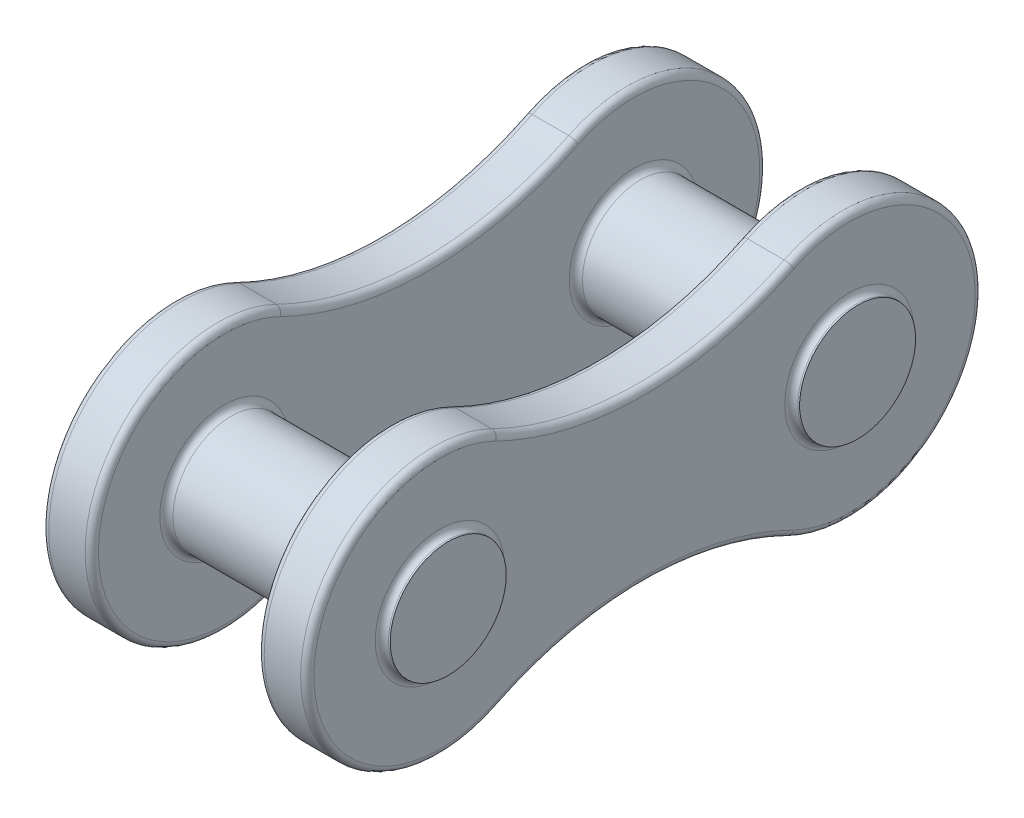
ISO-10303-21;
HEADER;
FILE_DESCRIPTION(('STEP AP214'),'2;1');
FILE_NAME('part.step','',(''),(''),'','','');
FILE_SCHEMA(('AUTOMOTIVE_DESIGN { 1 0 10303 214 1 1 1 1 }'));
ENDSEC;
DATA;
#1=APPLICATION_CONTEXT('core data for automotive mechanical design processes');
#2=APPLICATION_PROTOCOL_DEFINITION('international standard','automotive_design',2000,#1);
#3=PRODUCT_CONTEXT('',#1,'mechanical');
#4=PRODUCT('Part','Part','',(#3));
#5=PRODUCT_RELATED_PRODUCT_CATEGORY('part','',(#4));
#6=PRODUCT_DEFINITION_FORMATION('','',#4);
#7=PRODUCT_DEFINITION_CONTEXT('part definition',#1,'design');
#8=PRODUCT_DEFINITION('design','',#6,#7);
#9=PRODUCT_DEFINITION_SHAPE('','',#8);
#10=(LENGTH_UNIT() NAMED_UNIT(*) SI_UNIT(.MILLI.,.METRE.));
#11=(NAMED_UNIT(*) PLANE_ANGLE_UNIT() SI_UNIT($,.RADIAN.));
#12=(NAMED_UNIT(*) SI_UNIT($,.STERADIAN.) SOLID_ANGLE_UNIT());
#13=UNCERTAINTY_MEASURE_WITH_UNIT(LENGTH_MEASURE(1.E-05),#10,'distance_accuracy_value','');
#14=(GEOMETRIC_REPRESENTATION_CONTEXT(3) GLOBAL_UNCERTAINTY_ASSIGNED_CONTEXT((#13)) GLOBAL_UNIT_ASSIGNED_CONTEXT((#10,
#11,#12)) REPRESENTATION_CONTEXT('',''));
#15=CARTESIAN_POINT('',(0.,0.,0.));
#16=DIRECTION('',(0.,0.,1.));
#17=DIRECTION('',(1.,0.,0.));
#18=AXIS2_PLACEMENT_3D('',#15,#16,#17);
#19=CARTESIAN_POINT('',(4.,6.28230401604379,-3.0875));
#20=DIRECTION('',(1.,0.,0.));
#21=DIRECTION('',(0.,0.,-1.));
#22=AXIS2_PLACEMENT_3D('',#19,#20,#21);
#23=PLANE('',#22);
#24=CARTESIAN_POINT('',(4.,0.,-6.175));
#25=DIRECTION('',(1.,0.,0.));
#26=DIRECTION('',(0.,0.,-1.));
#27=AXIS2_PLACEMENT_3D('',#24,#25,#26);
#28=CIRCLE('',#27,1.95);
#29=CARTESIAN_POINT('',(4.,0.,-8.125));
#30=VERTEX_POINT('',#29);
#31=EDGE_CURVE('E45',#30,#30,#28,.F.);
#32=ORIENTED_EDGE('',*,*,#31,.T.);
#33=EDGE_LOOP('',(#32));
#34=FACE_BOUND('',#33,.T.);
#35=CARTESIAN_POINT('',(4.,-12.5646080320876,0.));
#36=DIRECTION('',(1.,0.,0.));
#37=DIRECTION('',(0.,0.,-1.));
#38=AXIS2_PLACEMENT_3D('',#35,#36,#37);
#39=CIRCLE('',#38,10.2);
#40=CARTESIAN_POINT('',(4.,-3.41039360870949,4.49892857142857));
#41=VERTEX_POINT('',#40);
#42=CARTESIAN_POINT('',(4.,-3.41039360870949,-4.49892857142857));
#43=VERTEX_POINT('',#42);
#44=EDGE_CURVE('E53',#41,#43,#39,.F.);
#45=ORIENTED_EDGE('',*,*,#44,.T.);
#46=CARTESIAN_POINT('',(4.,0.,-6.175));
#47=DIRECTION('',(1.,0.,0.));
#48=DIRECTION('',(0.,0.,-1.));
#49=AXIS2_PLACEMENT_3D('',#46,#47,#48);
#50=CIRCLE('',#49,3.8);
#51=CARTESIAN_POINT('',(4.,3.41039360870949,-4.49892857142857));
#52=VERTEX_POINT('',#51);
#53=EDGE_CURVE('E274',#43,#52,#50,.T.);
#54=ORIENTED_EDGE('',*,*,#53,.T.);
#55=CARTESIAN_POINT('',(4.,12.5646080320876,0.));
#56=DIRECTION('',(1.,0.,0.));
#57=DIRECTION('',(0.,0.,-1.));
#58=AXIS2_PLACEMENT_3D('',#55,#56,#57);
#59=CIRCLE('',#58,10.2);
#60=CARTESIAN_POINT('',(4.,3.41039360870949,4.49892857142857));
#61=VERTEX_POINT('',#60);
#62=EDGE_CURVE('E270',#52,#61,#59,.F.);
#63=ORIENTED_EDGE('',*,*,#62,.T.);
#64=CARTESIAN_POINT('',(4.,0.,6.175));
#65=DIRECTION('',(1.,0.,0.));
#66=DIRECTION('',(0.,0.,-1.));
#67=AXIS2_PLACEMENT_3D('',#64,#65,#66);
#68=CIRCLE('',#67,3.8);
#69=EDGE_CURVE('E58',#61,#41,#68,.T.);
#70=ORIENTED_EDGE('',*,*,#69,.T.);
#71=EDGE_LOOP('',(#45,#54,#63,#70));
#72=FACE_BOUND('',#71,.T.);
#73=CARTESIAN_POINT('',(4.,0.,6.175));
#74=DIRECTION('',(1.,0.,0.));
#75=DIRECTION('',(0.,0.,-1.));
#76=AXIS2_PLACEMENT_3D('',#73,#74,#75);
#77=CIRCLE('',#76,1.95);
#78=CARTESIAN_POINT('',(4.,0.,4.225));
#79=VERTEX_POINT('',#78);
#80=EDGE_CURVE('E267',#79,#79,#77,.F.);
#81=ORIENTED_EDGE('',*,*,#80,.T.);
#82=EDGE_LOOP('',(#81));
#83=FACE_BOUND('',#82,.T.);
#84=ADVANCED_FACE('F36',(#34,#72,#83),#23,.T.);
#85=CARTESIAN_POINT('',(2.5,6.28230401604379,-3.0875));
#86=DIRECTION('',(1.,0.,0.));
#87=DIRECTION('',(0.,0.,-1.));
#88=AXIS2_PLACEMENT_3D('',#85,#86,#87);
#89=PLANE('',#88);
#90=CARTESIAN_POINT('',(2.5,0.,-6.175));
#91=DIRECTION('',(1.,0.,0.));
#92=DIRECTION('',(0.,0.,-1.));
#93=AXIS2_PLACEMENT_3D('',#90,#91,#92);
#94=CIRCLE('',#93,1.95);
#95=CARTESIAN_POINT('',(2.5,0.,-8.125));
#96=VERTEX_POINT('',#95);
#97=EDGE_CURVE('E181',#96,#96,#94,.T.);
#98=ORIENTED_EDGE('',*,*,#97,.T.);
#99=EDGE_LOOP('',(#98));
#100=FACE_BOUND('',#99,.T.);
#101=CARTESIAN_POINT('',(2.5,0.,6.175));
#102=DIRECTION('',(1.,0.,0.));
#103=DIRECTION('',(0.,0.,-1.));
#104=AXIS2_PLACEMENT_3D('',#101,#102,#103);
#105=CIRCLE('',#104,1.95);
#106=CARTESIAN_POINT('',(2.5,0.,4.225));
#107=VERTEX_POINT('',#106);
#108=EDGE_CURVE('E178',#107,#107,#105,.T.);
#109=ORIENTED_EDGE('',*,*,#108,.T.);
#110=EDGE_LOOP('',(#109));
#111=FACE_BOUND('',#110,.T.);
#112=CARTESIAN_POINT('',(2.5,-12.5646080320876,0.));
#113=DIRECTION('',(1.,0.,0.));
#114=DIRECTION('',(0.,0.,-1.));
#115=AXIS2_PLACEMENT_3D('',#112,#113,#114);
#116=CIRCLE('',#115,10.2);
#117=CARTESIAN_POINT('',(2.5,-3.41039360870949,-4.49892857142857));
#118=VERTEX_POINT('',#117);
#119=CARTESIAN_POINT('',(2.5,-3.41039360870949,4.49892857142857));
#120=VERTEX_POINT('',#119);
#121=EDGE_CURVE('E177',#118,#120,#116,.T.);
#122=ORIENTED_EDGE('',*,*,#121,.T.);
#123=CARTESIAN_POINT('',(2.5,0.,6.175));
#124=DIRECTION('',(1.,0.,0.));
#125=DIRECTION('',(0.,0.,-1.));
#126=AXIS2_PLACEMENT_3D('',#123,#124,#125);
#127=CIRCLE('',#126,3.8);
#128=CARTESIAN_POINT('',(2.5,3.41039360870949,4.49892857142857));
#129=VERTEX_POINT('',#128);
#130=EDGE_CURVE('E156',#120,#129,#127,.F.);
#131=ORIENTED_EDGE('',*,*,#130,.T.);
#132=CARTESIAN_POINT('',(2.5,12.5646080320876,0.));
#133=DIRECTION('',(1.,0.,0.));
#134=DIRECTION('',(0.,0.,-1.));
#135=AXIS2_PLACEMENT_3D('',#132,#133,#134);
#136=CIRCLE('',#135,10.2);
#137=CARTESIAN_POINT('',(2.5,3.41039360870949,-4.49892857142857));
#138=VERTEX_POINT('',#137);
#139=EDGE_CURVE('E166',#129,#138,#136,.T.);
#140=ORIENTED_EDGE('',*,*,#139,.T.);
#141=CARTESIAN_POINT('',(2.5,0.,-6.175));
#142=DIRECTION('',(1.,0.,0.));
#143=DIRECTION('',(0.,0.,-1.));
#144=AXIS2_PLACEMENT_3D('',#141,#142,#143);
#145=CIRCLE('',#144,3.8);
#146=EDGE_CURVE('E172',#138,#118,#145,.F.);
#147=ORIENTED_EDGE('',*,*,#146,.T.);
#148=EDGE_LOOP('',(#122,#131,#140,#147));
#149=FACE_BOUND('',#148,.T.);
#150=ADVANCED_FACE('F175',(#100,#111,#149),#89,.F.);
#151=CARTESIAN_POINT('',(4.,12.5646080320876,0.));
#152=DIRECTION('',(-1.,0.,0.));
#153=DIRECTION('',(0.,0.,1.));
#154=AXIS2_PLACEMENT_3D('',#151,#152,#153);
#155=CYLINDRICAL_SURFACE('',#154,10.);
#156=DIRECTION('',(-1.,0.,0.));
#157=VECTOR('',#156,1.);
#158=CARTESIAN_POINT('',(4.,3.58988800916788,-4.41071428571429));
#159=LINE('',#158,#157);
#160=CARTESIAN_POINT('',(3.8,3.58988800916788,-4.41071428571429));
#161=VERTEX_POINT('',#160);
#162=CARTESIAN_POINT('',(2.7,3.58988800916788,-4.41071428571429));
#163=VERTEX_POINT('',#162);
#164=EDGE_CURVE('E352',#161,#163,#159,.T.);
#165=ORIENTED_EDGE('',*,*,#164,.T.);
#166=CARTESIAN_POINT('',(2.7,12.5646080320876,0.));
#167=DIRECTION('',(1.,0.,0.));
#168=DIRECTION('',(0.,0.,-1.));
#169=AXIS2_PLACEMENT_3D('',#166,#167,#168);
#170=CIRCLE('',#169,10.);
#171=CARTESIAN_POINT('',(2.7,3.58988800916788,4.41071428571429));
#172=VERTEX_POINT('',#171);
#173=EDGE_CURVE('E208',#163,#172,#170,.F.);
#174=ORIENTED_EDGE('',*,*,#173,.T.);
#175=DIRECTION('',(-1.,0.,0.));
#176=VECTOR('',#175,1.);
#177=CARTESIAN_POINT('',(4.,3.58988800916788,4.41071428571429));
#178=LINE('',#177,#176);
#179=CARTESIAN_POINT('',(3.8,3.58988800916788,4.41071428571429));
#180=VERTEX_POINT('',#179);
#181=EDGE_CURVE('E324',#180,#172,#178,.T.);
#182=ORIENTED_EDGE('',*,*,#181,.F.);
#183=CARTESIAN_POINT('',(3.8,12.5646080320876,0.));
#184=DIRECTION('',(1.,0.,0.));
#185=DIRECTION('',(0.,0.,-1.));
#186=AXIS2_PLACEMENT_3D('',#183,#184,#185);
#187=CIRCLE('',#186,10.);
#188=EDGE_CURVE('E206',#180,#161,#187,.T.);
#189=ORIENTED_EDGE('',*,*,#188,.T.);
#190=EDGE_LOOP('',(#165,#174,#182,#189));
#191=FACE_BOUND('',#190,.T.);
#192=ADVANCED_FACE('F329',(#191),#155,.F.);
#193=CARTESIAN_POINT('',(4.,0.,6.175));
#194=DIRECTION('',(-1.,0.,0.));
#195=DIRECTION('',(0.,0.,1.));
#196=AXIS2_PLACEMENT_3D('',#193,#194,#195);
#197=CYLINDRICAL_SURFACE('',#196,4.);
#198=ORIENTED_EDGE('',*,*,#181,.T.);
#199=CARTESIAN_POINT('',(2.7,0.,6.175));
#200=DIRECTION('',(1.,0.,0.));
#201=DIRECTION('',(0.,0.,-1.));
#202=AXIS2_PLACEMENT_3D('',#199,#200,#201);
#203=CIRCLE('',#202,4.);
#204=CARTESIAN_POINT('',(2.7,-3.58988800916788,4.41071428571429));
#205=VERTEX_POINT('',#204);
#206=EDGE_CURVE('E159',#172,#205,#203,.T.);
#207=ORIENTED_EDGE('',*,*,#206,.T.);
#208=DIRECTION('',(-1.,0.,0.));
#209=VECTOR('',#208,1.);
#210=CARTESIAN_POINT('',(4.,-3.58988800916788,4.41071428571429));
#211=LINE('',#210,#209);
#212=CARTESIAN_POINT('',(3.8,-3.58988800916788,4.41071428571429));
#213=VERTEX_POINT('',#212);
#214=EDGE_CURVE('E326',#213,#205,#211,.T.);
#215=ORIENTED_EDGE('',*,*,#214,.F.);
#216=CARTESIAN_POINT('',(3.8,0.,6.175));
#217=DIRECTION('',(1.,0.,0.));
#218=DIRECTION('',(0.,0.,-1.));
#219=AXIS2_PLACEMENT_3D('',#216,#217,#218);
#220=CIRCLE('',#219,4.);
#221=EDGE_CURVE('E194',#213,#180,#220,.F.);
#222=ORIENTED_EDGE('',*,*,#221,.T.);
#223=EDGE_LOOP('',(#198,#207,#215,#222));
#224=FACE_BOUND('',#223,.T.);
#225=ADVANCED_FACE('F323',(#224),#197,.T.);
#226=CARTESIAN_POINT('',(4.,-12.5646080320876,0.));
#227=DIRECTION('',(-1.,0.,0.));
#228=DIRECTION('',(0.,0.,1.));
#229=AXIS2_PLACEMENT_3D('',#226,#227,#228);
#230=CYLINDRICAL_SURFACE('',#229,10.);
#231=ORIENTED_EDGE('',*,*,#214,.T.);
#232=CARTESIAN_POINT('',(2.7,-12.5646080320876,0.));
#233=DIRECTION('',(1.,0.,0.));
#234=DIRECTION('',(0.,0.,-1.));
#235=AXIS2_PLACEMENT_3D('',#232,#233,#234);
#236=CIRCLE('',#235,10.);
#237=CARTESIAN_POINT('',(2.7,-3.58988800916788,-4.41071428571429));
#238=VERTEX_POINT('',#237);
#239=EDGE_CURVE('E199',#205,#238,#236,.F.);
#240=ORIENTED_EDGE('',*,*,#239,.T.);
#241=DIRECTION('',(-1.,0.,0.));
#242=VECTOR('',#241,1.);
#243=CARTESIAN_POINT('',(4.,-3.58988800916788,-4.41071428571429));
#244=LINE('',#243,#242);
#245=CARTESIAN_POINT('',(3.8,-3.58988800916788,-4.41071428571429));
#246=VERTEX_POINT('',#245);
#247=EDGE_CURVE('E335',#246,#238,#244,.T.);
#248=ORIENTED_EDGE('',*,*,#247,.F.);
#249=CARTESIAN_POINT('',(3.8,-12.5646080320876,0.));
#250=DIRECTION('',(1.,0.,0.));
#251=DIRECTION('',(0.,0.,-1.));
#252=AXIS2_PLACEMENT_3D('',#249,#250,#251);
#253=CIRCLE('',#252,10.);
#254=EDGE_CURVE('E197',#246,#213,#253,.T.);
#255=ORIENTED_EDGE('',*,*,#254,.T.);
#256=EDGE_LOOP('',(#231,#240,#248,#255));
#257=FACE_BOUND('',#256,.T.);
#258=ADVANCED_FACE('F350',(#257),#230,.F.);
#259=CARTESIAN_POINT('',(4.,0.,-6.175));
#260=DIRECTION('',(-1.,0.,0.));
#261=DIRECTION('',(0.,0.,1.));
#262=AXIS2_PLACEMENT_3D('',#259,#260,#261);
#263=CYLINDRICAL_SURFACE('',#262,4.);
#264=ORIENTED_EDGE('',*,*,#247,.T.);
#265=CARTESIAN_POINT('',(2.7,0.,-6.175));
#266=DIRECTION('',(1.,0.,0.));
#267=DIRECTION('',(0.,0.,-1.));
#268=AXIS2_PLACEMENT_3D('',#265,#266,#267);
#269=CIRCLE('',#268,4.);
#270=EDGE_CURVE('E204',#238,#163,#269,.T.);
#271=ORIENTED_EDGE('',*,*,#270,.T.);
#272=ORIENTED_EDGE('',*,*,#164,.F.);
#273=CARTESIAN_POINT('',(3.8,0.,-6.175));
#274=DIRECTION('',(1.,0.,0.));
#275=DIRECTION('',(0.,0.,-1.));
#276=AXIS2_PLACEMENT_3D('',#273,#274,#275);
#277=CIRCLE('',#276,4.);
#278=EDGE_CURVE('E201',#161,#246,#277,.F.);
#279=ORIENTED_EDGE('',*,*,#278,.T.);
#280=EDGE_LOOP('',(#264,#271,#272,#279));
#281=FACE_BOUND('',#280,.T.);
#282=ADVANCED_FACE('F412',(#281),#263,.T.);
#283=CARTESIAN_POINT('',(4.25,0.,-6.175));
#284=DIRECTION('',(-1.,0.,0.));
#285=DIRECTION('',(0.,0.,1.));
#286=AXIS2_PLACEMENT_3D('',#283,#284,#285);
#287=CYLINDRICAL_SURFACE('',#286,1.75);
#288=CARTESIAN_POINT('',(2.3,0.,-6.175));
#289=DIRECTION('',(1.,0.,0.));
#290=DIRECTION('',(0.,0.,-1.));
#291=AXIS2_PLACEMENT_3D('',#288,#289,#290);
#292=CIRCLE('',#291,1.75);
#293=CARTESIAN_POINT('',(2.3,0.,-7.925));
#294=VERTEX_POINT('',#293);
#295=EDGE_CURVE('E173',#294,#294,#292,.F.);
#296=ORIENTED_EDGE('',*,*,#295,.T.);
#297=EDGE_LOOP('',(#296));
#298=FACE_BOUND('',#297,.T.);
#299=CARTESIAN_POINT('',(-2.3,0.,-6.175));
#300=DIRECTION('',(1.,0.,0.));
#301=DIRECTION('',(0.,0.,-1.));
#302=AXIS2_PLACEMENT_3D('',#299,#300,#301);
#303=CIRCLE('',#302,1.75);
#304=CARTESIAN_POINT('',(-2.3,0.,-7.925));
#305=VERTEX_POINT('',#304);
#306=EDGE_CURVE('E331',#305,#305,#303,.T.);
#307=ORIENTED_EDGE('',*,*,#306,.T.);
#308=EDGE_LOOP('',(#307));
#309=FACE_BOUND('',#308,.T.);
#310=ADVANCED_FACE('F415',(#298,#309),#287,.T.);
#311=CARTESIAN_POINT('',(4.2,0.,-6.175));
#312=DIRECTION('',(1.,0.,0.));
#313=DIRECTION('',(0.,0.,-1.));
#314=AXIS2_PLACEMENT_3D('',#311,#312,#313);
#315=CIRCLE('',#314,1.75);
#316=CARTESIAN_POINT('',(4.2,0.,-7.925));
#317=VERTEX_POINT('',#316);
#318=EDGE_CURVE('E264',#317,#317,#315,.T.);
#319=ORIENTED_EDGE('',*,*,#318,.T.);
#320=EDGE_LOOP('',(#319));
#321=FACE_BOUND('',#320,.T.);
#322=CARTESIAN_POINT('',(4.25,0.,-6.175));
#323=DIRECTION('',(1.,0.,0.));
#324=DIRECTION('',(0.,0.,-1.));
#325=AXIS2_PLACEMENT_3D('',#322,#323,#324);
#326=CIRCLE('',#325,1.75);
#327=CARTESIAN_POINT('',(4.25,0.,-7.925));
#328=VERTEX_POINT('',#327);
#329=EDGE_CURVE('E353',#328,#328,#326,.T.);
#330=ORIENTED_EDGE('',*,*,#329,.F.);
#331=EDGE_LOOP('',(#330));
#332=FACE_BOUND('',#331,.T.);
#333=ADVANCED_FACE('F409',(#321,#332),#287,.T.);
#334=CARTESIAN_POINT('',(4.25,0.,-6.175));
#335=DIRECTION('',(1.,0.,0.));
#336=DIRECTION('',(0.,0.,-1.));
#337=AXIS2_PLACEMENT_3D('',#334,#335,#336);
#338=PLANE('',#337);
#339=ORIENTED_EDGE('',*,*,#329,.T.);
#340=EDGE_LOOP('',(#339));
#341=FACE_BOUND('',#340,.T.);
#342=ADVANCED_FACE('F671',(#341),#338,.T.);
#343=CARTESIAN_POINT('',(-4.,0.,6.175));
#344=DIRECTION('',(1.,0.,0.));
#345=DIRECTION('',(0.,0.,-1.));
#346=AXIS2_PLACEMENT_3D('',#343,#344,#345);
#347=CYLINDRICAL_SURFACE('',#346,4.);
#348=DIRECTION('',(1.,0.,0.));
#349=VECTOR('',#348,1.);
#350=CARTESIAN_POINT('',(-4.,3.58988800916788,4.41071428571428));
#351=LINE('',#350,#349);
#352=CARTESIAN_POINT('',(-3.8,3.58988800916788,4.41071428571428));
#353=VERTEX_POINT('',#352);
#354=CARTESIAN_POINT('',(-2.7,3.58988800916788,4.41071428571428));
#355=VERTEX_POINT('',#354);
#356=EDGE_CURVE('E359',#353,#355,#351,.T.);
#357=ORIENTED_EDGE('',*,*,#356,.F.);
#358=CARTESIAN_POINT('',(-3.8,0.,6.175));
#359=DIRECTION('',(1.,0.,0.));
#360=DIRECTION('',(0.,0.,-1.));
#361=AXIS2_PLACEMENT_3D('',#358,#359,#360);
#362=CIRCLE('',#361,4.);
#363=CARTESIAN_POINT('',(-3.8,-3.58988800916788,4.41071428571429));
#364=VERTEX_POINT('',#363);
#365=EDGE_CURVE('E241',#353,#364,#362,.T.);
#366=ORIENTED_EDGE('',*,*,#365,.T.);
#367=DIRECTION('',(1.,0.,0.));
#368=VECTOR('',#367,1.);
#369=CARTESIAN_POINT('',(-4.,-3.58988800916788,4.41071428571429));
#370=LINE('',#369,#368);
#371=CARTESIAN_POINT('',(-2.7,-3.58988800916788,4.41071428571429));
#372=VERTEX_POINT('',#371);
#373=EDGE_CURVE('E362',#364,#372,#370,.T.);
#374=ORIENTED_EDGE('',*,*,#373,.T.);
#375=CARTESIAN_POINT('',(-2.7,0.,6.175));
#376=DIRECTION('',(1.,0.,0.));
#377=DIRECTION('',(0.,0.,-1.));
#378=AXIS2_PLACEMENT_3D('',#375,#376,#377);
#379=CIRCLE('',#378,4.);
#380=EDGE_CURVE('E239',#372,#355,#379,.F.);
#381=ORIENTED_EDGE('',*,*,#380,.T.);
#382=EDGE_LOOP('',(#357,#366,#374,#381));
#383=FACE_BOUND('',#382,.T.);
#384=ADVANCED_FACE('F676',(#383),#347,.T.);
#385=CARTESIAN_POINT('',(-4.,12.5646080320876,0.));
#386=DIRECTION('',(1.,0.,0.));
#387=DIRECTION('',(0.,0.,-1.));
#388=AXIS2_PLACEMENT_3D('',#385,#386,#387);
#389=CYLINDRICAL_SURFACE('',#388,10.);
#390=DIRECTION('',(1.,0.,0.));
#391=VECTOR('',#390,1.);
#392=CARTESIAN_POINT('',(-4.,3.58988800916788,-4.41071428571429));
#393=LINE('',#392,#391);
#394=CARTESIAN_POINT('',(-3.8,3.58988800916788,-4.41071428571429));
#395=VERTEX_POINT('',#394);
#396=CARTESIAN_POINT('',(-2.7,3.58988800916788,-4.41071428571429));
#397=VERTEX_POINT('',#396);
#398=EDGE_CURVE('E369',#395,#397,#393,.T.);
#399=ORIENTED_EDGE('',*,*,#398,.F.);
#400=CARTESIAN_POINT('',(-3.8,12.5646080320876,0.));
#401=DIRECTION('',(1.,0.,0.));
#402=DIRECTION('',(0.,0.,-1.));
#403=AXIS2_PLACEMENT_3D('',#400,#401,#402);
#404=CIRCLE('',#403,10.);
#405=EDGE_CURVE('E237',#395,#353,#404,.F.);
#406=ORIENTED_EDGE('',*,*,#405,.T.);
#407=ORIENTED_EDGE('',*,*,#356,.T.);
#408=CARTESIAN_POINT('',(-2.7,12.5646080320876,0.));
#409=DIRECTION('',(1.,0.,0.));
#410=DIRECTION('',(0.,0.,-1.));
#411=AXIS2_PLACEMENT_3D('',#408,#409,#410);
#412=CIRCLE('',#411,10.);
#413=EDGE_CURVE('E234',#355,#397,#412,.T.);
#414=ORIENTED_EDGE('',*,*,#413,.T.);
#415=EDGE_LOOP('',(#399,#406,#407,#414));
#416=FACE_BOUND('',#415,.T.);
#417=ADVANCED_FACE('F726',(#416),#389,.F.);
#418=CARTESIAN_POINT('',(-4.,0.,-6.175));
#419=DIRECTION('',(1.,0.,0.));
#420=DIRECTION('',(0.,0.,-1.));
#421=AXIS2_PLACEMENT_3D('',#418,#419,#420);
#422=CYLINDRICAL_SURFACE('',#421,4.);
#423=DIRECTION('',(1.,0.,0.));
#424=VECTOR('',#423,1.);
#425=CARTESIAN_POINT('',(-4.,-3.58988800916788,-4.41071428571429));
#426=LINE('',#425,#424);
#427=CARTESIAN_POINT('',(-3.8,-3.58988800916788,-4.41071428571429));
#428=VERTEX_POINT('',#427);
#429=CARTESIAN_POINT('',(-2.7,-3.58988800916788,-4.41071428571429));
#430=VERTEX_POINT('',#429);
#431=EDGE_CURVE('E365',#428,#430,#426,.T.);
#432=ORIENTED_EDGE('',*,*,#431,.F.);
#433=CARTESIAN_POINT('',(-3.8,0.,-6.175));
#434=DIRECTION('',(1.,0.,0.));
#435=DIRECTION('',(0.,0.,-1.));
#436=AXIS2_PLACEMENT_3D('',#433,#434,#435);
#437=CIRCLE('',#436,4.);
#438=EDGE_CURVE('E232',#428,#395,#437,.T.);
#439=ORIENTED_EDGE('',*,*,#438,.T.);
#440=ORIENTED_EDGE('',*,*,#398,.T.);
#441=CARTESIAN_POINT('',(-2.7,0.,-6.175));
#442=DIRECTION('',(1.,0.,0.));
#443=DIRECTION('',(0.,0.,-1.));
#444=AXIS2_PLACEMENT_3D('',#441,#442,#443);
#445=CIRCLE('',#444,4.);
#446=EDGE_CURVE('E230',#397,#430,#445,.F.);
#447=ORIENTED_EDGE('',*,*,#446,.T.);
#448=EDGE_LOOP('',(#432,#439,#440,#447));
#449=FACE_BOUND('',#448,.T.);
#450=ADVANCED_FACE('F717',(#449),#422,.T.);
#451=CARTESIAN_POINT('',(-4.,-12.5646080320876,0.));
#452=DIRECTION('',(1.,0.,0.));
#453=DIRECTION('',(0.,0.,-1.));
#454=AXIS2_PLACEMENT_3D('',#451,#452,#453);
#455=CYLINDRICAL_SURFACE('',#454,10.);
#456=ORIENTED_EDGE('',*,*,#373,.F.);
#457=CARTESIAN_POINT('',(-3.8,-12.5646080320876,0.));
#458=DIRECTION('',(1.,0.,0.));
#459=DIRECTION('',(0.,0.,-1.));
#460=AXIS2_PLACEMENT_3D('',#457,#458,#459);
#461=CIRCLE('',#460,10.);
#462=EDGE_CURVE('E212',#364,#428,#461,.F.);
#463=ORIENTED_EDGE('',*,*,#462,.T.);
#464=ORIENTED_EDGE('',*,*,#431,.T.);
#465=CARTESIAN_POINT('',(-2.7,-12.5646080320876,0.));
#466=DIRECTION('',(1.,0.,0.));
#467=DIRECTION('',(0.,0.,-1.));
#468=AXIS2_PLACEMENT_3D('',#465,#466,#467);
#469=CIRCLE('',#468,10.);
#470=EDGE_CURVE('E210',#430,#372,#469,.T.);
#471=ORIENTED_EDGE('',*,*,#470,.T.);
#472=EDGE_LOOP('',(#456,#463,#464,#471));
#473=FACE_BOUND('',#472,.T.);
#474=ADVANCED_FACE('F709',(#473),#455,.F.);
#475=CARTESIAN_POINT('',(-4.,-6.28230401604379,3.0875));
#476=DIRECTION('',(1.,0.,0.));
#477=DIRECTION('',(0.,0.,-1.));
#478=AXIS2_PLACEMENT_3D('',#475,#476,#477);
#479=PLANE('',#478);
#480=CARTESIAN_POINT('',(-4.,0.,-6.175));
#481=DIRECTION('',(1.,0.,0.));
#482=DIRECTION('',(0.,0.,-1.));
#483=AXIS2_PLACEMENT_3D('',#480,#481,#482);
#484=CIRCLE('',#483,3.8);
#485=CARTESIAN_POINT('',(-4.,3.41039360870949,-4.49892857142857));
#486=VERTEX_POINT('',#485);
#487=CARTESIAN_POINT('',(-4.,-3.41039360870949,-4.49892857142857));
#488=VERTEX_POINT('',#487);
#489=EDGE_CURVE('E225',#486,#488,#484,.F.);
#490=ORIENTED_EDGE('',*,*,#489,.T.);
#491=CARTESIAN_POINT('',(-4.,-12.5646080320876,0.));
#492=DIRECTION('',(1.,0.,0.));
#493=DIRECTION('',(0.,0.,-1.));
#494=AXIS2_PLACEMENT_3D('',#491,#492,#493);
#495=CIRCLE('',#494,10.2);
#496=CARTESIAN_POINT('',(-4.,-3.41039360870949,4.49892857142857));
#497=VERTEX_POINT('',#496);
#498=EDGE_CURVE('E227',#488,#497,#495,.T.);
#499=ORIENTED_EDGE('',*,*,#498,.T.);
#500=CARTESIAN_POINT('',(-4.,0.,6.175));
#501=DIRECTION('',(1.,0.,0.));
#502=DIRECTION('',(0.,0.,-1.));
#503=AXIS2_PLACEMENT_3D('',#500,#501,#502);
#504=CIRCLE('',#503,3.8);
#505=CARTESIAN_POINT('',(-4.,3.41039360870948,4.49892857142857));
#506=VERTEX_POINT('',#505);
#507=EDGE_CURVE('E221',#497,#506,#504,.F.);
#508=ORIENTED_EDGE('',*,*,#507,.T.);
#509=CARTESIAN_POINT('',(-4.,12.5646080320876,0.));
#510=DIRECTION('',(1.,0.,0.));
#511=DIRECTION('',(0.,0.,-1.));
#512=AXIS2_PLACEMENT_3D('',#509,#510,#511);
#513=CIRCLE('',#512,10.2);
#514=EDGE_CURVE('E223',#506,#486,#513,.T.);
#515=ORIENTED_EDGE('',*,*,#514,.T.);
#516=EDGE_LOOP('',(#490,#499,#508,#515));
#517=FACE_BOUND('',#516,.T.);
#518=CARTESIAN_POINT('',(-4.,0.,-6.175));
#519=DIRECTION('',(1.,0.,0.));
#520=DIRECTION('',(0.,0.,-1.));
#521=AXIS2_PLACEMENT_3D('',#518,#519,#520);
#522=CIRCLE('',#521,1.95);
#523=CARTESIAN_POINT('',(-4.,0.,-8.125));
#524=VERTEX_POINT('',#523);
#525=EDGE_CURVE('E218',#524,#524,#522,.T.);
#526=ORIENTED_EDGE('',*,*,#525,.T.);
#527=EDGE_LOOP('',(#526));
#528=FACE_BOUND('',#527,.T.);
#529=CARTESIAN_POINT('',(-4.,0.,6.175));
#530=DIRECTION('',(1.,0.,0.));
#531=DIRECTION('',(0.,0.,-1.));
#532=AXIS2_PLACEMENT_3D('',#529,#530,#531);
#533=CIRCLE('',#532,1.95);
#534=CARTESIAN_POINT('',(-4.,0.,4.225));
#535=VERTEX_POINT('',#534);
#536=EDGE_CURVE('E215',#535,#535,#533,.T.);
#537=ORIENTED_EDGE('',*,*,#536,.T.);
#538=EDGE_LOOP('',(#537));
#539=FACE_BOUND('',#538,.T.);
#540=ADVANCED_FACE('F700',(#517,#528,#539),#479,.F.);
#541=CARTESIAN_POINT('',(-2.5,-6.28230401604379,3.0875));
#542=DIRECTION('',(1.,0.,0.));
#543=DIRECTION('',(0.,0.,-1.));
#544=AXIS2_PLACEMENT_3D('',#541,#542,#543);
#545=PLANE('',#544);
#546=CARTESIAN_POINT('',(-2.5,0.,-6.175));
#547=DIRECTION('',(1.,0.,0.));
#548=DIRECTION('',(0.,0.,-1.));
#549=AXIS2_PLACEMENT_3D('',#546,#547,#548);
#550=CIRCLE('',#549,3.8);
#551=CARTESIAN_POINT('',(-2.5,-3.41039360870949,-4.49892857142857));
#552=VERTEX_POINT('',#551);
#553=CARTESIAN_POINT('',(-2.5,3.41039360870949,-4.49892857142857));
#554=VERTEX_POINT('',#553);
#555=EDGE_CURVE('E259',#552,#554,#550,.T.);
#556=ORIENTED_EDGE('',*,*,#555,.T.);
#557=CARTESIAN_POINT('',(-2.5,12.5646080320876,0.));
#558=DIRECTION('',(1.,0.,0.));
#559=DIRECTION('',(0.,0.,-1.));
#560=AXIS2_PLACEMENT_3D('',#557,#558,#559);
#561=CIRCLE('',#560,10.2);
#562=CARTESIAN_POINT('',(-2.5,3.41039360870948,4.49892857142857));
#563=VERTEX_POINT('',#562);
#564=EDGE_CURVE('E261',#554,#563,#561,.F.);
#565=ORIENTED_EDGE('',*,*,#564,.T.);
#566=CARTESIAN_POINT('',(-2.5,0.,6.175));
#567=DIRECTION('',(1.,0.,0.));
#568=DIRECTION('',(0.,0.,-1.));
#569=AXIS2_PLACEMENT_3D('',#566,#567,#568);
#570=CIRCLE('',#569,3.8);
#571=CARTESIAN_POINT('',(-2.5,-3.41039360870949,4.49892857142857));
#572=VERTEX_POINT('',#571);
#573=EDGE_CURVE('E255',#563,#572,#570,.T.);
#574=ORIENTED_EDGE('',*,*,#573,.T.);
#575=CARTESIAN_POINT('',(-2.5,-12.5646080320876,0.));
#576=DIRECTION('',(1.,0.,0.));
#577=DIRECTION('',(0.,0.,-1.));
#578=AXIS2_PLACEMENT_3D('',#575,#576,#577);
#579=CIRCLE('',#578,10.2);
#580=EDGE_CURVE('E257',#572,#552,#579,.F.);
#581=ORIENTED_EDGE('',*,*,#580,.T.);
#582=EDGE_LOOP('',(#556,#565,#574,#581));
#583=FACE_BOUND('',#582,.T.);
#584=CARTESIAN_POINT('',(-2.5,0.,-6.175));
#585=DIRECTION('',(1.,0.,0.));
#586=DIRECTION('',(0.,0.,-1.));
#587=AXIS2_PLACEMENT_3D('',#584,#585,#586);
#588=CIRCLE('',#587,1.95);
#589=CARTESIAN_POINT('',(-2.5,0.,-8.125));
#590=VERTEX_POINT('',#589);
#591=EDGE_CURVE('E252',#590,#590,#588,.F.);
#592=ORIENTED_EDGE('',*,*,#591,.T.);
#593=EDGE_LOOP('',(#592));
#594=FACE_BOUND('',#593,.T.);
#595=CARTESIAN_POINT('',(-2.5,0.,6.175));
#596=DIRECTION('',(1.,0.,0.));
#597=DIRECTION('',(0.,0.,-1.));
#598=AXIS2_PLACEMENT_3D('',#595,#596,#597);
#599=CIRCLE('',#598,1.95);
#600=CARTESIAN_POINT('',(-2.5,0.,4.225));
#601=VERTEX_POINT('',#600);
#602=EDGE_CURVE('E249',#601,#601,#599,.F.);
#603=ORIENTED_EDGE('',*,*,#602,.T.);
#604=EDGE_LOOP('',(#603));
#605=FACE_BOUND('',#604,.T.);
#606=ADVANCED_FACE('F667',(#583,#594,#605),#545,.T.);
#607=CARTESIAN_POINT('',(-4.25,0.,-6.175));
#608=DIRECTION('',(1.,0.,0.));
#609=DIRECTION('',(0.,0.,-1.));
#610=AXIS2_PLACEMENT_3D('',#607,#608,#609);
#611=PLANE('',#610);
#612=CARTESIAN_POINT('',(-4.25,0.,-6.175));
#613=DIRECTION('',(1.,0.,0.));
#614=DIRECTION('',(0.,0.,-1.));
#615=AXIS2_PLACEMENT_3D('',#612,#613,#614);
#616=CIRCLE('',#615,1.75);
#617=CARTESIAN_POINT('',(-4.25,0.,-7.925));
#618=VERTEX_POINT('',#617);
#619=EDGE_CURVE('E356',#618,#618,#616,.T.);
#620=ORIENTED_EDGE('',*,*,#619,.F.);
#621=EDGE_LOOP('',(#620));
#622=FACE_BOUND('',#621,.T.);
#623=ADVANCED_FACE('F659',(#622),#611,.F.);
#624=CARTESIAN_POINT('',(-4.2,0.,-6.175));
#625=DIRECTION('',(1.,0.,0.));
#626=DIRECTION('',(0.,0.,-1.));
#627=AXIS2_PLACEMENT_3D('',#624,#625,#626);
#628=CIRCLE('',#627,1.75);
#629=CARTESIAN_POINT('',(-4.2,0.,-7.925));
#630=VERTEX_POINT('',#629);
#631=EDGE_CURVE('E243',#630,#630,#628,.F.);
#632=ORIENTED_EDGE('',*,*,#631,.T.);
#633=EDGE_LOOP('',(#632));
#634=FACE_BOUND('',#633,.T.);
#635=ORIENTED_EDGE('',*,*,#619,.T.);
#636=EDGE_LOOP('',(#635));
#637=FACE_BOUND('',#636,.T.);
#638=ADVANCED_FACE('F398',(#634,#637),#287,.T.);
#639=CARTESIAN_POINT('',(4.25,0.,6.175));
#640=DIRECTION('',(-1.,0.,0.));
#641=DIRECTION('',(0.,0.,1.));
#642=AXIS2_PLACEMENT_3D('',#639,#640,#641);
#643=CYLINDRICAL_SURFACE('',#642,1.75);
#644=CARTESIAN_POINT('',(2.3,0.,6.175));
#645=DIRECTION('',(1.,0.,0.));
#646=DIRECTION('',(0.,0.,-1.));
#647=AXIS2_PLACEMENT_3D('',#644,#645,#646);
#648=CIRCLE('',#647,1.75);
#649=CARTESIAN_POINT('',(2.3,0.,4.425));
#650=VERTEX_POINT('',#649);
#651=EDGE_CURVE('E191',#650,#650,#648,.F.);
#652=ORIENTED_EDGE('',*,*,#651,.T.);
#653=EDGE_LOOP('',(#652));
#654=FACE_BOUND('',#653,.T.);
#655=CARTESIAN_POINT('',(-2.3,0.,6.175));
#656=DIRECTION('',(1.,0.,0.));
#657=DIRECTION('',(0.,0.,-1.));
#658=AXIS2_PLACEMENT_3D('',#655,#656,#657);
#659=CIRCLE('',#658,1.75);
#660=CARTESIAN_POINT('',(-2.3,0.,4.425));
#661=VERTEX_POINT('',#660);
#662=EDGE_CURVE('E188',#661,#661,#659,.T.);
#663=ORIENTED_EDGE('',*,*,#662,.T.);
#664=EDGE_LOOP('',(#663));
#665=FACE_BOUND('',#664,.T.);
#666=ADVANCED_FACE('F386',(#654,#665),#643,.T.);
#667=CARTESIAN_POINT('',(-4.25,0.,6.175));
#668=DIRECTION('',(1.,0.,0.));
#669=DIRECTION('',(0.,0.,-1.));
#670=AXIS2_PLACEMENT_3D('',#667,#668,#669);
#671=PLANE('',#670);
#672=CARTESIAN_POINT('',(-4.25,0.,6.175));
#673=DIRECTION('',(1.,0.,0.));
#674=DIRECTION('',(0.,0.,-1.));
#675=AXIS2_PLACEMENT_3D('',#672,#673,#674);
#676=CIRCLE('',#675,1.75);
#677=CARTESIAN_POINT('',(-4.25,0.,4.425));
#678=VERTEX_POINT('',#677);
#679=EDGE_CURVE('E283',#678,#678,#676,.T.);
#680=ORIENTED_EDGE('',*,*,#679,.F.);
#681=EDGE_LOOP('',(#680));
#682=FACE_BOUND('',#681,.T.);
#683=ADVANCED_FACE('F393',(#682),#671,.F.);
#684=CARTESIAN_POINT('',(-4.2,0.,6.175));
#685=DIRECTION('',(1.,0.,0.));
#686=DIRECTION('',(0.,0.,-1.));
#687=AXIS2_PLACEMENT_3D('',#684,#685,#686);
#688=CIRCLE('',#687,1.75);
#689=CARTESIAN_POINT('',(-4.2,0.,4.425));
#690=VERTEX_POINT('',#689);
#691=EDGE_CURVE('E246',#690,#690,#688,.F.);
#692=ORIENTED_EDGE('',*,*,#691,.T.);
#693=EDGE_LOOP('',(#692));
#694=FACE_BOUND('',#693,.T.);
#695=ORIENTED_EDGE('',*,*,#679,.T.);
#696=EDGE_LOOP('',(#695));
#697=FACE_BOUND('',#696,.T.);
#698=ADVANCED_FACE('F383',(#694,#697),#643,.T.);
#699=CARTESIAN_POINT('',(4.2,0.,6.175));
#700=DIRECTION('',(1.,0.,0.));
#701=DIRECTION('',(0.,0.,-1.));
#702=AXIS2_PLACEMENT_3D('',#699,#700,#701);
#703=CIRCLE('',#702,1.75);
#704=CARTESIAN_POINT('',(4.2,0.,4.425));
#705=VERTEX_POINT('',#704);
#706=EDGE_CURVE('E11',#705,#705,#703,.T.);
#707=ORIENTED_EDGE('',*,*,#706,.T.);
#708=EDGE_LOOP('',(#707));
#709=FACE_BOUND('',#708,.T.);
#710=CARTESIAN_POINT('',(4.25,0.,6.175));
#711=DIRECTION('',(1.,0.,0.));
#712=DIRECTION('',(0.,0.,-1.));
#713=AXIS2_PLACEMENT_3D('',#710,#711,#712);
#714=CIRCLE('',#713,1.75);
#715=CARTESIAN_POINT('',(4.25,0.,4.425));
#716=VERTEX_POINT('',#715);
#717=EDGE_CURVE('E366',#716,#716,#714,.T.);
#718=ORIENTED_EDGE('',*,*,#717,.F.);
#719=EDGE_LOOP('',(#718));
#720=FACE_BOUND('',#719,.T.);
#721=ADVANCED_FACE('F381',(#709,#720),#643,.T.);
#722=CARTESIAN_POINT('',(4.25,0.,6.175));
#723=DIRECTION('',(1.,0.,0.));
#724=DIRECTION('',(0.,0.,-1.));
#725=AXIS2_PLACEMENT_3D('',#722,#723,#724);
#726=PLANE('',#725);
#727=ORIENTED_EDGE('',*,*,#717,.T.);
#728=EDGE_LOOP('',(#727));
#729=FACE_BOUND('',#728,.T.);
#730=ADVANCED_FACE('F379',(#729),#726,.T.);
#731=CARTESIAN_POINT('',(2.3,0.,-6.175));
#732=DIRECTION('',(1.,0.,0.));
#733=DIRECTION('',(0.,0.,-1.));
#734=AXIS2_PLACEMENT_3D('',#731,#732,#733);
#735=TOROIDAL_SURFACE('',#734,1.95,0.2);
#736=ORIENTED_EDGE('',*,*,#97,.F.);
#737=EDGE_LOOP('',(#736));
#738=FACE_BOUND('',#737,.T.);
#739=ORIENTED_EDGE('',*,*,#295,.F.);
#740=EDGE_LOOP('',(#739));
#741=FACE_BOUND('',#740,.T.);
#742=ADVANCED_FACE('F391',(#738,#741),#735,.F.);
#743=CARTESIAN_POINT('',(2.3,0.,6.175));
#744=DIRECTION('',(1.,0.,0.));
#745=DIRECTION('',(0.,0.,-1.));
#746=AXIS2_PLACEMENT_3D('',#743,#744,#745);
#747=TOROIDAL_SURFACE('',#746,1.95,0.2);
#748=ORIENTED_EDGE('',*,*,#108,.F.);
#749=EDGE_LOOP('',(#748));
#750=FACE_BOUND('',#749,.T.);
#751=ORIENTED_EDGE('',*,*,#651,.F.);
#752=EDGE_LOOP('',(#751));
#753=FACE_BOUND('',#752,.T.);
#754=ADVANCED_FACE('F424',(#750,#753),#747,.F.);
#755=CARTESIAN_POINT('',(2.7,0.,-6.175));
#756=DIRECTION('',(1.,0.,0.));
#757=DIRECTION('',(0.,0.,-1.));
#758=AXIS2_PLACEMENT_3D('',#755,#756,#757);
#759=TOROIDAL_SURFACE('',#758,3.8,0.2);
#760=CARTESIAN_POINT('',(2.7,-3.41039360870949,-4.49892857142857));
#761=DIRECTION('',(0.,0.44107142857143,0.89747200229197));
#762=DIRECTION('',(0.,-0.89747200229197,0.44107142857143));
#763=AXIS2_PLACEMENT_3D('',#760,#761,#762);
#764=CIRCLE('',#763,0.2);
#765=EDGE_CURVE('E162',#118,#238,#764,.T.);
#766=ORIENTED_EDGE('',*,*,#765,.F.);
#767=ORIENTED_EDGE('',*,*,#146,.F.);
#768=CARTESIAN_POINT('',(2.7,3.41039360870949,-4.49892857142857));
#769=DIRECTION('',(0.,-0.44107142857143,0.89747200229197));
#770=DIRECTION('',(0.,-0.89747200229197,-0.44107142857143));
#771=AXIS2_PLACEMENT_3D('',#768,#769,#770);
#772=CIRCLE('',#771,0.2);
#773=EDGE_CURVE('E169',#163,#138,#772,.T.);
#774=ORIENTED_EDGE('',*,*,#773,.F.);
#775=ORIENTED_EDGE('',*,*,#270,.F.);
#776=EDGE_LOOP('',(#766,#767,#774,#775));
#777=FACE_BOUND('',#776,.T.);
#778=ADVANCED_FACE('F343',(#777),#759,.T.);
#779=CARTESIAN_POINT('',(2.7,12.5646080320876,0.));
#780=DIRECTION('',(1.,0.,0.));
#781=DIRECTION('',(0.,0.,-1.));
#782=AXIS2_PLACEMENT_3D('',#779,#780,#781);
#783=TOROIDAL_SURFACE('',#782,10.2,0.2);
#784=ORIENTED_EDGE('',*,*,#773,.T.);
#785=ORIENTED_EDGE('',*,*,#139,.F.);
#786=CARTESIAN_POINT('',(2.7,3.41039360870949,4.49892857142857));
#787=DIRECTION('',(0.,0.44107142857143,0.89747200229197));
#788=DIRECTION('',(0.,-0.89747200229197,0.44107142857143));
#789=AXIS2_PLACEMENT_3D('',#786,#787,#788);
#790=CIRCLE('',#789,0.2);
#791=EDGE_CURVE('E152',#172,#129,#790,.T.);
#792=ORIENTED_EDGE('',*,*,#791,.F.);
#793=ORIENTED_EDGE('',*,*,#173,.F.);
#794=EDGE_LOOP('',(#784,#785,#792,#793));
#795=FACE_BOUND('',#794,.T.);
#796=ADVANCED_FACE('F167',(#795),#783,.T.);
#797=CARTESIAN_POINT('',(2.7,-12.5646080320876,0.));
#798=DIRECTION('',(1.,0.,0.));
#799=DIRECTION('',(0.,0.,-1.));
#800=AXIS2_PLACEMENT_3D('',#797,#798,#799);
#801=TOROIDAL_SURFACE('',#800,10.2,0.2);
#802=ORIENTED_EDGE('',*,*,#765,.T.);
#803=ORIENTED_EDGE('',*,*,#239,.F.);
#804=CARTESIAN_POINT('',(2.7,-3.41039360870949,4.49892857142857));
#805=DIRECTION('',(0.,-0.44107142857143,0.89747200229197));
#806=DIRECTION('',(0.,-0.89747200229197,-0.44107142857143));
#807=AXIS2_PLACEMENT_3D('',#804,#805,#806);
#808=CIRCLE('',#807,0.2);
#809=EDGE_CURVE('E163',#120,#205,#808,.T.);
#810=ORIENTED_EDGE('',*,*,#809,.F.);
#811=ORIENTED_EDGE('',*,*,#121,.F.);
#812=EDGE_LOOP('',(#802,#803,#810,#811));
#813=FACE_BOUND('',#812,.T.);
#814=ADVANCED_FACE('F346',(#813),#801,.T.);
#815=CARTESIAN_POINT('',(2.7,0.,6.175));
#816=DIRECTION('',(1.,0.,0.));
#817=DIRECTION('',(0.,0.,-1.));
#818=AXIS2_PLACEMENT_3D('',#815,#816,#817);
#819=TOROIDAL_SURFACE('',#818,3.8,0.2);
#820=ORIENTED_EDGE('',*,*,#791,.T.);
#821=ORIENTED_EDGE('',*,*,#130,.F.);
#822=ORIENTED_EDGE('',*,*,#809,.T.);
#823=ORIENTED_EDGE('',*,*,#206,.F.);
#824=EDGE_LOOP('',(#820,#821,#822,#823));
#825=FACE_BOUND('',#824,.T.);
#826=ADVANCED_FACE('F154',(#825),#819,.T.);
#827=CARTESIAN_POINT('',(-3.8,12.5646080320876,0.));
#828=DIRECTION('',(1.,0.,0.));
#829=DIRECTION('',(0.,0.,-1.));
#830=AXIS2_PLACEMENT_3D('',#827,#828,#829);
#831=TOROIDAL_SURFACE('',#830,10.2,0.2);
#832=CARTESIAN_POINT('',(-3.8,3.41039360870949,-4.49892857142857));
#833=DIRECTION('',(0.,0.44107142857143,-0.89747200229197));
#834=DIRECTION('',(0.,0.89747200229197,0.44107142857143));
#835=AXIS2_PLACEMENT_3D('',#832,#833,#834);
#836=CIRCLE('',#835,0.2);
#837=EDGE_CURVE('E289',#486,#395,#836,.T.);
#838=ORIENTED_EDGE('',*,*,#837,.F.);
#839=ORIENTED_EDGE('',*,*,#514,.F.);
#840=CARTESIAN_POINT('',(-3.8,3.41039360870949,4.49892857142857));
#841=DIRECTION('',(0.,0.441071428571426,0.897472002291972));
#842=DIRECTION('',(0.,-0.897472002291972,0.441071428571426));
#843=AXIS2_PLACEMENT_3D('',#840,#841,#842);
#844=CIRCLE('',#843,0.2);
#845=EDGE_CURVE('E278',#353,#506,#844,.T.);
#846=ORIENTED_EDGE('',*,*,#845,.F.);
#847=ORIENTED_EDGE('',*,*,#405,.F.);
#848=EDGE_LOOP('',(#838,#839,#846,#847));
#849=FACE_BOUND('',#848,.T.);
#850=ADVANCED_FACE('F431',(#849),#831,.T.);
#851=CARTESIAN_POINT('',(-3.8,0.,6.175));
#852=DIRECTION('',(1.,0.,0.));
#853=DIRECTION('',(0.,0.,-1.));
#854=AXIS2_PLACEMENT_3D('',#851,#852,#853);
#855=TOROIDAL_SURFACE('',#854,3.8,0.2);
#856=ORIENTED_EDGE('',*,*,#845,.T.);
#857=ORIENTED_EDGE('',*,*,#507,.F.);
#858=CARTESIAN_POINT('',(-3.8,-3.41039360870949,4.49892857142857));
#859=DIRECTION('',(0.,0.44107142857143,-0.89747200229197));
#860=DIRECTION('',(0.,0.89747200229197,0.44107142857143));
#861=AXIS2_PLACEMENT_3D('',#858,#859,#860);
#862=CIRCLE('',#861,0.2);
#863=EDGE_CURVE('E286',#364,#497,#862,.T.);
#864=ORIENTED_EDGE('',*,*,#863,.F.);
#865=ORIENTED_EDGE('',*,*,#365,.F.);
#866=EDGE_LOOP('',(#856,#857,#864,#865));
#867=FACE_BOUND('',#866,.T.);
#868=ADVANCED_FACE('F446',(#867),#855,.T.);
#869=CARTESIAN_POINT('',(-3.8,0.,-6.175));
#870=DIRECTION('',(1.,0.,0.));
#871=DIRECTION('',(0.,0.,-1.));
#872=AXIS2_PLACEMENT_3D('',#869,#870,#871);
#873=TOROIDAL_SURFACE('',#872,3.8,0.2);
#874=ORIENTED_EDGE('',*,*,#837,.T.);
#875=ORIENTED_EDGE('',*,*,#438,.F.);
#876=CARTESIAN_POINT('',(-3.8,-3.41039360870949,-4.49892857142857));
#877=DIRECTION('',(0.,0.44107142857143,0.89747200229197));
#878=DIRECTION('',(0.,-0.89747200229197,0.44107142857143));
#879=AXIS2_PLACEMENT_3D('',#876,#877,#878);
#880=CIRCLE('',#879,0.2);
#881=EDGE_CURVE('E284',#488,#428,#880,.T.);
#882=ORIENTED_EDGE('',*,*,#881,.F.);
#883=ORIENTED_EDGE('',*,*,#489,.F.);
#884=EDGE_LOOP('',(#874,#875,#882,#883));
#885=FACE_BOUND('',#884,.T.);
#886=ADVANCED_FACE('F442',(#885),#873,.T.);
#887=CARTESIAN_POINT('',(-3.8,-12.5646080320876,0.));
#888=DIRECTION('',(1.,0.,0.));
#889=DIRECTION('',(0.,0.,-1.));
#890=AXIS2_PLACEMENT_3D('',#887,#888,#889);
#891=TOROIDAL_SURFACE('',#890,10.2,0.2);
#892=ORIENTED_EDGE('',*,*,#863,.T.);
#893=ORIENTED_EDGE('',*,*,#498,.F.);
#894=ORIENTED_EDGE('',*,*,#881,.T.);
#895=ORIENTED_EDGE('',*,*,#462,.F.);
#896=EDGE_LOOP('',(#892,#893,#894,#895));
#897=FACE_BOUND('',#896,.T.);
#898=ADVANCED_FACE('F438',(#897),#891,.T.);
#899=CARTESIAN_POINT('',(-4.2,0.,-6.175));
#900=DIRECTION('',(1.,0.,0.));
#901=DIRECTION('',(0.,0.,-1.));
#902=AXIS2_PLACEMENT_3D('',#899,#900,#901);
#903=TOROIDAL_SURFACE('',#902,1.95,0.2);
#904=ORIENTED_EDGE('',*,*,#631,.F.);
#905=EDGE_LOOP('',(#904));
#906=FACE_BOUND('',#905,.T.);
#907=ORIENTED_EDGE('',*,*,#525,.F.);
#908=EDGE_LOOP('',(#907));
#909=FACE_BOUND('',#908,.T.);
#910=ADVANCED_FACE('F441',(#906,#909),#903,.F.);
#911=CARTESIAN_POINT('',(-4.2,0.,6.175));
#912=DIRECTION('',(1.,0.,0.));
#913=DIRECTION('',(0.,0.,-1.));
#914=AXIS2_PLACEMENT_3D('',#911,#912,#913);
#915=TOROIDAL_SURFACE('',#914,1.95,0.2);
#916=ORIENTED_EDGE('',*,*,#536,.F.);
#917=EDGE_LOOP('',(#916));
#918=FACE_BOUND('',#917,.T.);
#919=ORIENTED_EDGE('',*,*,#691,.F.);
#920=EDGE_LOOP('',(#919));
#921=FACE_BOUND('',#920,.T.);
#922=ADVANCED_FACE('F456',(#918,#921),#915,.F.);
#923=CARTESIAN_POINT('',(-2.7,-12.5646080320876,0.));
#924=DIRECTION('',(1.,0.,0.));
#925=DIRECTION('',(0.,0.,-1.));
#926=AXIS2_PLACEMENT_3D('',#923,#924,#925);
#927=TOROIDAL_SURFACE('',#926,10.2,0.2);
#928=CARTESIAN_POINT('',(-2.7,-3.41039360870949,4.49892857142857));
#929=DIRECTION('',(0.,-0.44107142857143,0.89747200229197));
#930=DIRECTION('',(0.,-0.89747200229197,-0.44107142857143));
#931=AXIS2_PLACEMENT_3D('',#928,#929,#930);
#932=CIRCLE('',#931,0.2);
#933=EDGE_CURVE('E298',#372,#572,#932,.T.);
#934=ORIENTED_EDGE('',*,*,#933,.F.);
#935=ORIENTED_EDGE('',*,*,#470,.F.);
#936=CARTESIAN_POINT('',(-2.7,-3.41039360870949,-4.49892857142857));
#937=DIRECTION('',(0.,-0.44107142857143,-0.89747200229197));
#938=DIRECTION('',(0.,0.89747200229197,-0.44107142857143));
#939=AXIS2_PLACEMENT_3D('',#936,#937,#938);
#940=CIRCLE('',#939,0.2);
#941=EDGE_CURVE('E287',#552,#430,#940,.T.);
#942=ORIENTED_EDGE('',*,*,#941,.F.);
#943=ORIENTED_EDGE('',*,*,#580,.F.);
#944=EDGE_LOOP('',(#934,#935,#942,#943));
#945=FACE_BOUND('',#944,.T.);
#946=ADVANCED_FACE('F460',(#945),#927,.T.);
#947=CARTESIAN_POINT('',(-2.7,0.,-6.175));
#948=DIRECTION('',(1.,0.,0.));
#949=DIRECTION('',(0.,0.,-1.));
#950=AXIS2_PLACEMENT_3D('',#947,#948,#949);
#951=TOROIDAL_SURFACE('',#950,3.8,0.2);
#952=ORIENTED_EDGE('',*,*,#941,.T.);
#953=ORIENTED_EDGE('',*,*,#446,.F.);
#954=CARTESIAN_POINT('',(-2.7,3.41039360870949,-4.49892857142857));
#955=DIRECTION('',(0.,-0.44107142857143,0.89747200229197));
#956=DIRECTION('',(0.,-0.89747200229197,-0.44107142857143));
#957=AXIS2_PLACEMENT_3D('',#954,#955,#956);
#958=CIRCLE('',#957,0.2);
#959=EDGE_CURVE('E296',#554,#397,#958,.T.);
#960=ORIENTED_EDGE('',*,*,#959,.F.);
#961=ORIENTED_EDGE('',*,*,#555,.F.);
#962=EDGE_LOOP('',(#952,#953,#960,#961));
#963=FACE_BOUND('',#962,.T.);
#964=ADVANCED_FACE('F470',(#963),#951,.T.);
#965=CARTESIAN_POINT('',(-2.7,0.,6.175));
#966=DIRECTION('',(1.,0.,0.));
#967=DIRECTION('',(0.,0.,-1.));
#968=AXIS2_PLACEMENT_3D('',#965,#966,#967);
#969=TOROIDAL_SURFACE('',#968,3.8,0.2);
#970=ORIENTED_EDGE('',*,*,#933,.T.);
#971=ORIENTED_EDGE('',*,*,#573,.F.);
#972=CARTESIAN_POINT('',(-2.7,3.41039360870949,4.49892857142857));
#973=DIRECTION('',(0.,-0.44107142857143,-0.89747200229197));
#974=DIRECTION('',(0.,0.89747200229197,-0.44107142857143));
#975=AXIS2_PLACEMENT_3D('',#972,#973,#974);
#976=CIRCLE('',#975,0.2);
#977=EDGE_CURVE('E294',#355,#563,#976,.T.);
#978=ORIENTED_EDGE('',*,*,#977,.F.);
#979=ORIENTED_EDGE('',*,*,#380,.F.);
#980=EDGE_LOOP('',(#970,#971,#978,#979));
#981=FACE_BOUND('',#980,.T.);
#982=ADVANCED_FACE('F466',(#981),#969,.T.);
#983=CARTESIAN_POINT('',(-2.7,12.5646080320876,0.));
#984=DIRECTION('',(1.,0.,0.));
#985=DIRECTION('',(0.,0.,-1.));
#986=AXIS2_PLACEMENT_3D('',#983,#984,#985);
#987=TOROIDAL_SURFACE('',#986,10.2,0.2);
#988=ORIENTED_EDGE('',*,*,#959,.T.);
#989=ORIENTED_EDGE('',*,*,#413,.F.);
#990=ORIENTED_EDGE('',*,*,#977,.T.);
#991=ORIENTED_EDGE('',*,*,#564,.F.);
#992=EDGE_LOOP('',(#988,#989,#990,#991));
#993=FACE_BOUND('',#992,.T.);
#994=ADVANCED_FACE('F462',(#993),#987,.T.);
#995=CARTESIAN_POINT('',(-2.3,0.,-6.175));
#996=DIRECTION('',(1.,0.,0.));
#997=DIRECTION('',(0.,0.,-1.));
#998=AXIS2_PLACEMENT_3D('',#995,#996,#997);
#999=TOROIDAL_SURFACE('',#998,1.95,0.2);
#1000=ORIENTED_EDGE('',*,*,#591,.F.);
#1001=EDGE_LOOP('',(#1000));
#1002=FACE_BOUND('',#1001,.T.);
#1003=ORIENTED_EDGE('',*,*,#306,.F.);
#1004=EDGE_LOOP('',(#1003));
#1005=FACE_BOUND('',#1004,.T.);
#1006=ADVANCED_FACE('F465',(#1002,#1005),#999,.F.);
#1007=CARTESIAN_POINT('',(-2.3,0.,6.175));
#1008=DIRECTION('',(1.,0.,0.));
#1009=DIRECTION('',(0.,0.,-1.));
#1010=AXIS2_PLACEMENT_3D('',#1007,#1008,#1009);
#1011=TOROIDAL_SURFACE('',#1010,1.95,0.2);
#1012=ORIENTED_EDGE('',*,*,#602,.F.);
#1013=EDGE_LOOP('',(#1012));
#1014=FACE_BOUND('',#1013,.T.);
#1015=ORIENTED_EDGE('',*,*,#662,.F.);
#1016=EDGE_LOOP('',(#1015));
#1017=FACE_BOUND('',#1016,.T.);
#1018=ADVANCED_FACE('F480',(#1014,#1017),#1011,.F.);
#1019=CARTESIAN_POINT('',(4.2,0.,-6.175));
#1020=DIRECTION('',(1.,0.,0.));
#1021=DIRECTION('',(0.,0.,-1.));
#1022=AXIS2_PLACEMENT_3D('',#1019,#1020,#1021);
#1023=TOROIDAL_SURFACE('',#1022,1.95,0.2);
#1024=ORIENTED_EDGE('',*,*,#31,.F.);
#1025=EDGE_LOOP('',(#1024));
#1026=FACE_BOUND('',#1025,.T.);
#1027=ORIENTED_EDGE('',*,*,#318,.F.);
#1028=EDGE_LOOP('',(#1027));
#1029=FACE_BOUND('',#1028,.T.);
#1030=ADVANCED_FACE('F484',(#1026,#1029),#1023,.F.);
#1031=CARTESIAN_POINT('',(3.8,0.,6.175));
#1032=DIRECTION('',(1.,0.,0.));
#1033=DIRECTION('',(0.,0.,-1.));
#1034=AXIS2_PLACEMENT_3D('',#1031,#1032,#1033);
#1035=TOROIDAL_SURFACE('',#1034,3.8,0.2);
#1036=CARTESIAN_POINT('',(3.8,3.41039360870949,4.49892857142857));
#1037=DIRECTION('',(0.,-0.44107142857143,-0.89747200229197));
#1038=DIRECTION('',(0.,0.89747200229197,-0.44107142857143));
#1039=AXIS2_PLACEMENT_3D('',#1036,#1037,#1038);
#1040=CIRCLE('',#1039,0.2);
#1041=EDGE_CURVE('E306',#180,#61,#1040,.T.);
#1042=ORIENTED_EDGE('',*,*,#1041,.F.);
#1043=ORIENTED_EDGE('',*,*,#221,.F.);
#1044=CARTESIAN_POINT('',(3.8,-3.41039360870949,4.49892857142857));
#1045=DIRECTION('',(0.,0.44107142857143,-0.89747200229197));
#1046=DIRECTION('',(0.,0.89747200229197,0.44107142857143));
#1047=AXIS2_PLACEMENT_3D('',#1044,#1045,#1046);
#1048=CIRCLE('',#1047,0.2);
#1049=EDGE_CURVE('E40',#41,#213,#1048,.T.);
#1050=ORIENTED_EDGE('',*,*,#1049,.F.);
#1051=ORIENTED_EDGE('',*,*,#69,.F.);
#1052=EDGE_LOOP('',(#1042,#1043,#1050,#1051));
#1053=FACE_BOUND('',#1052,.T.);
#1054=ADVANCED_FACE('F318',(#1053),#1035,.T.);
#1055=CARTESIAN_POINT('',(3.8,-12.5646080320876,0.));
#1056=DIRECTION('',(1.,0.,0.));
#1057=DIRECTION('',(0.,0.,-1.));
#1058=AXIS2_PLACEMENT_3D('',#1055,#1056,#1057);
#1059=TOROIDAL_SURFACE('',#1058,10.2,0.2);
#1060=ORIENTED_EDGE('',*,*,#1049,.T.);
#1061=ORIENTED_EDGE('',*,*,#254,.F.);
#1062=CARTESIAN_POINT('',(3.8,-3.41039360870949,-4.49892857142857));
#1063=DIRECTION('',(0.,-0.44107142857143,-0.89747200229197));
#1064=DIRECTION('',(0.,0.89747200229197,-0.44107142857143));
#1065=AXIS2_PLACEMENT_3D('',#1062,#1063,#1064);
#1066=CIRCLE('',#1065,0.2);
#1067=EDGE_CURVE('E305',#43,#246,#1066,.T.);
#1068=ORIENTED_EDGE('',*,*,#1067,.F.);
#1069=ORIENTED_EDGE('',*,*,#44,.F.);
#1070=EDGE_LOOP('',(#1060,#1061,#1068,#1069));
#1071=FACE_BOUND('',#1070,.T.);
#1072=ADVANCED_FACE('F315',(#1071),#1059,.T.);
#1073=CARTESIAN_POINT('',(3.8,12.5646080320876,0.));
#1074=DIRECTION('',(1.,0.,0.));
#1075=DIRECTION('',(0.,0.,-1.));
#1076=AXIS2_PLACEMENT_3D('',#1073,#1074,#1075);
#1077=TOROIDAL_SURFACE('',#1076,10.2,0.2);
#1078=ORIENTED_EDGE('',*,*,#1041,.T.);
#1079=ORIENTED_EDGE('',*,*,#62,.F.);
#1080=CARTESIAN_POINT('',(3.8,3.41039360870949,-4.49892857142857));
#1081=DIRECTION('',(0.,0.44107142857143,-0.89747200229197));
#1082=DIRECTION('',(0.,0.89747200229197,0.44107142857143));
#1083=AXIS2_PLACEMENT_3D('',#1080,#1081,#1082);
#1084=CIRCLE('',#1083,0.2);
#1085=EDGE_CURVE('E303',#161,#52,#1084,.T.);
#1086=ORIENTED_EDGE('',*,*,#1085,.F.);
#1087=ORIENTED_EDGE('',*,*,#188,.F.);
#1088=EDGE_LOOP('',(#1078,#1079,#1086,#1087));
#1089=FACE_BOUND('',#1088,.T.);
#1090=ADVANCED_FACE('F492',(#1089),#1077,.T.);
#1091=CARTESIAN_POINT('',(3.8,0.,-6.175));
#1092=DIRECTION('',(1.,0.,0.));
#1093=DIRECTION('',(0.,0.,-1.));
#1094=AXIS2_PLACEMENT_3D('',#1091,#1092,#1093);
#1095=TOROIDAL_SURFACE('',#1094,3.8,0.2);
#1096=ORIENTED_EDGE('',*,*,#1067,.T.);
#1097=ORIENTED_EDGE('',*,*,#278,.F.);
#1098=ORIENTED_EDGE('',*,*,#1085,.T.);
#1099=ORIENTED_EDGE('',*,*,#53,.F.);
#1100=EDGE_LOOP('',(#1096,#1097,#1098,#1099));
#1101=FACE_BOUND('',#1100,.T.);
#1102=ADVANCED_FACE('F489',(#1101),#1095,.T.);
#1103=CARTESIAN_POINT('',(4.2,0.,6.175));
#1104=DIRECTION('',(1.,0.,0.));
#1105=DIRECTION('',(0.,0.,-1.));
#1106=AXIS2_PLACEMENT_3D('',#1103,#1104,#1105);
#1107=TOROIDAL_SURFACE('',#1106,1.95,0.2);
#1108=ORIENTED_EDGE('',*,*,#80,.F.);
#1109=EDGE_LOOP('',(#1108));
#1110=FACE_BOUND('',#1109,.T.);
#1111=ORIENTED_EDGE('',*,*,#706,.F.);
#1112=EDGE_LOOP('',(#1111));
#1113=FACE_BOUND('',#1112,.T.);
#1114=ADVANCED_FACE('F38',(#1110,#1113),#1107,.F.);
#1115=CLOSED_SHELL('',(#84,#150,#192,#225,#258,#282,#310,#333,#342,#384,#417,#450,#474,#540,
#606,#623,#638,#666,#683,#698,#721,#730,#742,#754,#778,#796,#814,#826,#850,#868,#886,#898,#910,
#922,#946,#964,#982,#994,#1006,#1018,#1030,#1054,#1072,#1090,#1102,#1114));
#1116=MANIFOLD_SOLID_BREP('B2',#1115);
#1117=ADVANCED_BREP_SHAPE_REPRESENTATION('',(#18,#1116),#14);
#1118=SHAPE_DEFINITION_REPRESENTATION(#9,#1117);
ENDSEC;
END-ISO-10303-21;
